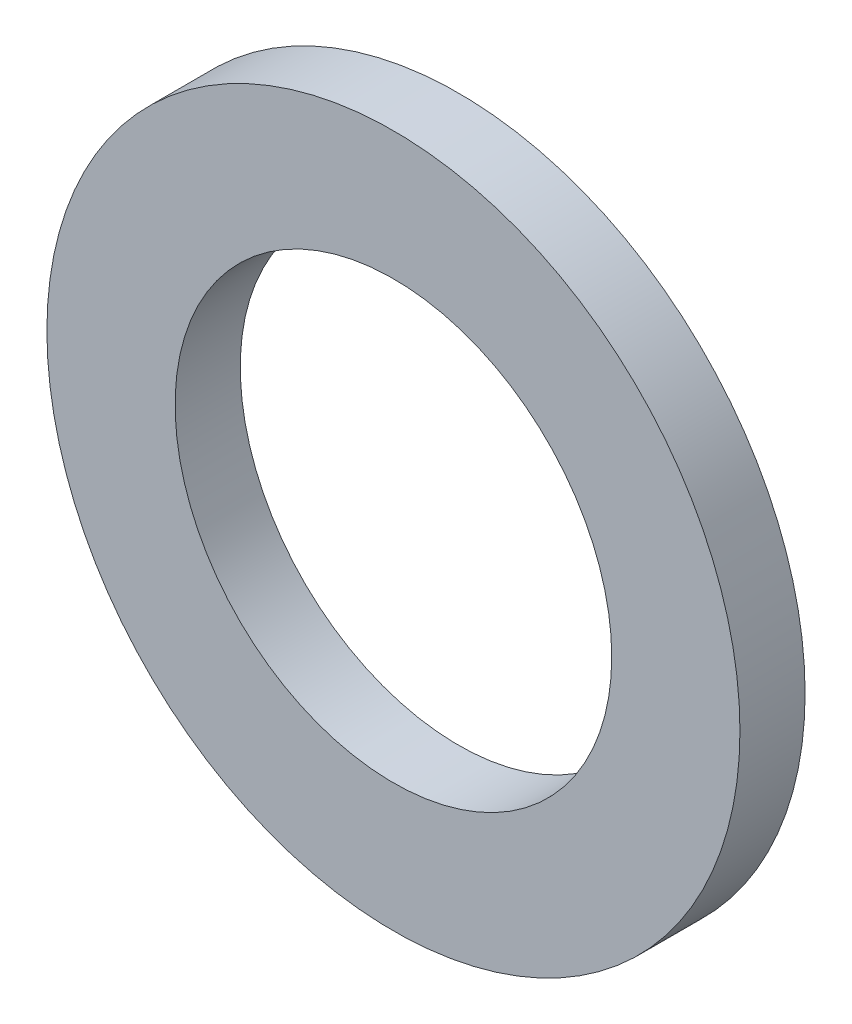
ISO-10303-21;
HEADER;
FILE_DESCRIPTION(('STEP AP214'),'2;1');
FILE_NAME('part.step','',(''),(''),'','','');
FILE_SCHEMA(('AUTOMOTIVE_DESIGN { 1 0 10303 214 1 1 1 1 }'));
ENDSEC;
DATA;
#1=APPLICATION_CONTEXT('core data for automotive mechanical design processes');
#2=APPLICATION_PROTOCOL_DEFINITION('international standard','automotive_design',2000,#1);
#3=PRODUCT_CONTEXT('',#1,'mechanical');
#4=PRODUCT('Part','Part','',(#3));
#5=PRODUCT_RELATED_PRODUCT_CATEGORY('part','',(#4));
#6=PRODUCT_DEFINITION_FORMATION('','',#4);
#7=PRODUCT_DEFINITION_CONTEXT('part definition',#1,'design');
#8=PRODUCT_DEFINITION('design','',#6,#7);
#9=PRODUCT_DEFINITION_SHAPE('','',#8);
#10=(LENGTH_UNIT() NAMED_UNIT(*) SI_UNIT(.MILLI.,.METRE.));
#11=(NAMED_UNIT(*) PLANE_ANGLE_UNIT() SI_UNIT($,.RADIAN.));
#12=(NAMED_UNIT(*) SI_UNIT($,.STERADIAN.) SOLID_ANGLE_UNIT());
#13=UNCERTAINTY_MEASURE_WITH_UNIT(LENGTH_MEASURE(1.E-05),#10,'distance_accuracy_value','');
#14=(GEOMETRIC_REPRESENTATION_CONTEXT(3) GLOBAL_UNCERTAINTY_ASSIGNED_CONTEXT((#13)) GLOBAL_UNIT_ASSIGNED_CONTEXT((#10,
#11,#12)) REPRESENTATION_CONTEXT('',''));
#15=CARTESIAN_POINT('',(0.,0.,0.));
#16=DIRECTION('',(0.,0.,1.));
#17=DIRECTION('',(1.,0.,0.));
#18=AXIS2_PLACEMENT_3D('',#15,#16,#17);
#19=CARTESIAN_POINT('',(0.,0.,0.));
#20=DIRECTION('',(0.,0.,1.));
#21=DIRECTION('',(1.,0.,0.));
#22=AXIS2_PLACEMENT_3D('',#19,#20,#21);
#23=CYLINDRICAL_SURFACE('',#22,8.001);
#24=CARTESIAN_POINT('',(0.,0.,2.3876));
#25=DIRECTION('',(0.,0.,1.));
#26=DIRECTION('',(1.,0.,0.));
#27=AXIS2_PLACEMENT_3D('',#24,#25,#26);
#28=CIRCLE('',#27,8.001);
#29=CARTESIAN_POINT('',(8.001,0.,2.3876));
#30=VERTEX_POINT('',#29);
#31=EDGE_CURVE('E28',#30,#30,#28,.F.);
#32=ORIENTED_EDGE('',*,*,#31,.F.);
#33=EDGE_LOOP('',(#32));
#34=FACE_BOUND('',#33,.T.);
#35=CARTESIAN_POINT('',(0.,0.,0.));
#36=DIRECTION('',(0.,0.,1.));
#37=DIRECTION('',(1.,0.,0.));
#38=AXIS2_PLACEMENT_3D('',#35,#36,#37);
#39=CIRCLE('',#38,8.001);
#40=CARTESIAN_POINT('',(8.001,0.,0.));
#41=VERTEX_POINT('',#40);
#42=EDGE_CURVE('E19',#41,#41,#39,.T.);
#43=ORIENTED_EDGE('',*,*,#42,.F.);
#44=EDGE_LOOP('',(#43));
#45=FACE_BOUND('',#44,.T.);
#46=ADVANCED_FACE('F15',(#34,#45),#23,.F.);
#47=CARTESIAN_POINT('',(12.7,-12.7,0.));
#48=DIRECTION('',(0.,0.,-1.));
#49=DIRECTION('',(-1.,0.,0.));
#50=AXIS2_PLACEMENT_3D('',#47,#48,#49);
#51=PLANE('',#50);
#52=ORIENTED_EDGE('',*,*,#42,.T.);
#53=EDGE_LOOP('',(#52));
#54=FACE_BOUND('',#53,.T.);
#55=CARTESIAN_POINT('',(0.,0.,0.));
#56=DIRECTION('',(0.,0.,-1.));
#57=DIRECTION('',(-1.,0.,0.));
#58=AXIS2_PLACEMENT_3D('',#55,#56,#57);
#59=CIRCLE('',#58,12.7);
#60=CARTESIAN_POINT('',(-12.7,0.,0.));
#61=VERTEX_POINT('',#60);
#62=EDGE_CURVE('E23',#61,#61,#59,.F.);
#63=ORIENTED_EDGE('',*,*,#62,.F.);
#64=EDGE_LOOP('',(#63));
#65=FACE_BOUND('',#64,.T.);
#66=ADVANCED_FACE('F36',(#54,#65),#51,.T.);
#67=CARTESIAN_POINT('',(-12.7,-12.7,2.3876));
#68=DIRECTION('',(0.,0.,1.));
#69=DIRECTION('',(1.,0.,0.));
#70=AXIS2_PLACEMENT_3D('',#67,#68,#69);
#71=PLANE('',#70);
#72=ORIENTED_EDGE('',*,*,#31,.T.);
#73=EDGE_LOOP('',(#72));
#74=FACE_BOUND('',#73,.T.);
#75=CARTESIAN_POINT('',(0.,0.,2.3876));
#76=DIRECTION('',(0.,0.,-1.));
#77=DIRECTION('',(-1.,0.,0.));
#78=AXIS2_PLACEMENT_3D('',#75,#76,#77);
#79=CIRCLE('',#78,12.7);
#80=CARTESIAN_POINT('',(-12.7,0.,2.3876));
#81=VERTEX_POINT('',#80);
#82=EDGE_CURVE('E10',#81,#81,#79,.T.);
#83=ORIENTED_EDGE('',*,*,#82,.F.);
#84=EDGE_LOOP('',(#83));
#85=FACE_BOUND('',#84,.T.);
#86=ADVANCED_FACE('F46',(#74,#85),#71,.T.);
#87=CARTESIAN_POINT('',(0.,0.,2.3876));
#88=DIRECTION('',(0.,0.,-1.));
#89=DIRECTION('',(-1.,0.,0.));
#90=AXIS2_PLACEMENT_3D('',#87,#88,#89);
#91=CYLINDRICAL_SURFACE('',#90,12.7);
#92=ORIENTED_EDGE('',*,*,#62,.T.);
#93=EDGE_LOOP('',(#92));
#94=FACE_BOUND('',#93,.T.);
#95=ORIENTED_EDGE('',*,*,#82,.T.);
#96=EDGE_LOOP('',(#95));
#97=FACE_BOUND('',#96,.T.);
#98=ADVANCED_FACE('F17',(#94,#97),#91,.T.);
#99=CLOSED_SHELL('',(#46,#66,#86,#98));
#100=MANIFOLD_SOLID_BREP('B1',#99);
#101=ADVANCED_BREP_SHAPE_REPRESENTATION('',(#18,#100),#14);
#102=SHAPE_DEFINITION_REPRESENTATION(#9,#101);
ENDSEC;
END-ISO-10303-21;
